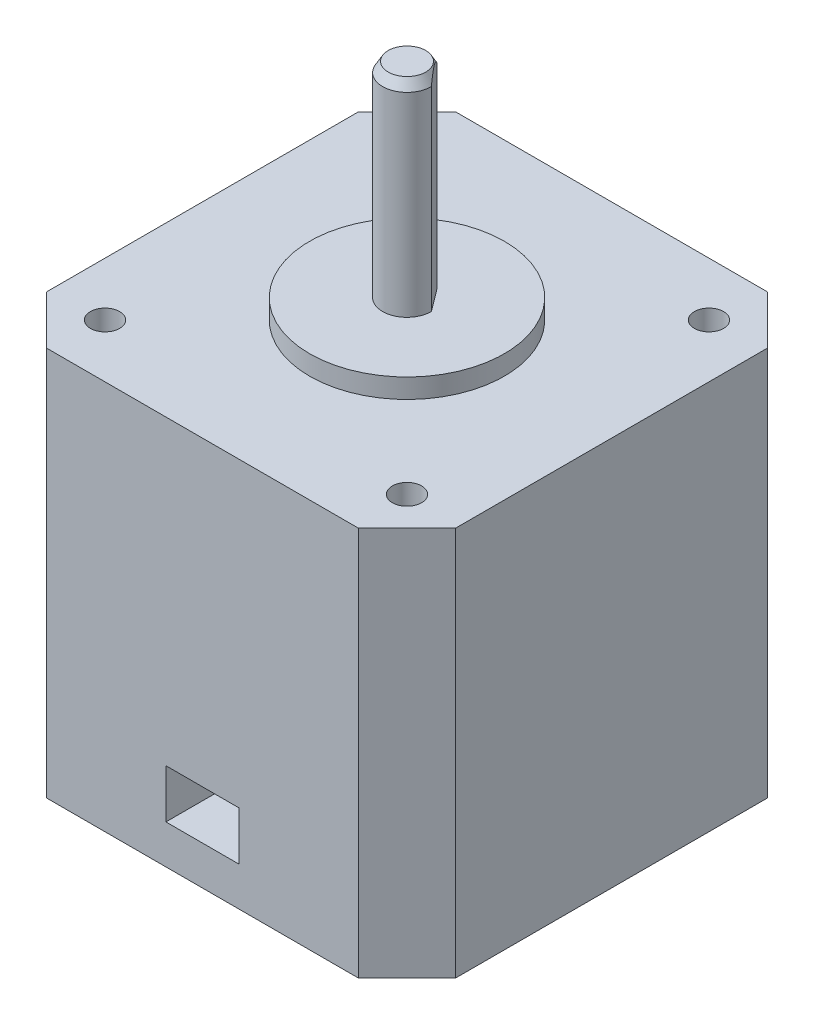
ISO-10303-21;
HEADER;
FILE_DESCRIPTION(('STEP AP214'),'2;1');
FILE_NAME('part.step','',(''),(''),'','','');
FILE_SCHEMA(('AUTOMOTIVE_DESIGN { 1 0 10303 214 1 1 1 1 }'));
ENDSEC;
DATA;
#1=APPLICATION_CONTEXT('core data for automotive mechanical design processes');
#2=APPLICATION_PROTOCOL_DEFINITION('international standard','automotive_design',2000,#1);
#3=PRODUCT_CONTEXT('',#1,'mechanical');
#4=PRODUCT('Part','Part','',(#3));
#5=PRODUCT_RELATED_PRODUCT_CATEGORY('part','',(#4));
#6=PRODUCT_DEFINITION_FORMATION('','',#4);
#7=PRODUCT_DEFINITION_CONTEXT('part definition',#1,'design');
#8=PRODUCT_DEFINITION('design','',#6,#7);
#9=PRODUCT_DEFINITION_SHAPE('','',#8);
#10=(LENGTH_UNIT() NAMED_UNIT(*) SI_UNIT(.MILLI.,.METRE.));
#11=(NAMED_UNIT(*) PLANE_ANGLE_UNIT() SI_UNIT($,.RADIAN.));
#12=(NAMED_UNIT(*) SI_UNIT($,.STERADIAN.) SOLID_ANGLE_UNIT());
#13=UNCERTAINTY_MEASURE_WITH_UNIT(LENGTH_MEASURE(1.E-05),#10,'distance_accuracy_value','');
#14=(GEOMETRIC_REPRESENTATION_CONTEXT(3) GLOBAL_UNCERTAINTY_ASSIGNED_CONTEXT((#13)) GLOBAL_UNIT_ASSIGNED_CONTEXT((#10,
#11,#12)) REPRESENTATION_CONTEXT('',''));
#15=CARTESIAN_POINT('',(0.,0.,0.));
#16=DIRECTION('',(0.,0.,1.));
#17=DIRECTION('',(1.,0.,0.));
#18=AXIS2_PLACEMENT_3D('',#15,#16,#17);
#19=CARTESIAN_POINT('',(0.,42.,0.));
#20=DIRECTION('',(0.,1.,0.));
#21=DIRECTION('',(0.,0.,1.));
#22=AXIS2_PLACEMENT_3D('',#19,#20,#21);
#23=PLANE('',#22);
#24=CARTESIAN_POINT('',(0.,42.,0.));
#25=DIRECTION('',(0.,1.,0.));
#26=DIRECTION('',(0.,0.,1.));
#27=AXIS2_PLACEMENT_3D('',#24,#25,#26);
#28=CIRCLE('',#27,10.);
#29=CARTESIAN_POINT('',(0.,42.,10.));
#30=VERTEX_POINT('',#29);
#31=EDGE_CURVE('E198',#30,#30,#28,.T.);
#32=ORIENTED_EDGE('',*,*,#31,.T.);
#33=EDGE_LOOP('',(#32));
#34=FACE_BOUND('',#33,.T.);
#35=DIRECTION('',(0.6,0.,0.8));
#36=VECTOR('',#35,1.);
#37=CARTESIAN_POINT('',(1.6,42.,-1.2));
#38=LINE('',#37,#36);
#39=CARTESIAN_POINT('',(0.7,42.,-2.4));
#40=VERTEX_POINT('',#39);
#41=CARTESIAN_POINT('',(2.5,42.,0.));
#42=VERTEX_POINT('',#41);
#43=EDGE_CURVE('E249',#40,#42,#38,.T.);
#44=ORIENTED_EDGE('',*,*,#43,.T.);
#45=CARTESIAN_POINT('',(0.,42.,0.));
#46=DIRECTION('',(0.,1.,0.));
#47=DIRECTION('',(0.,0.,1.));
#48=AXIS2_PLACEMENT_3D('',#45,#46,#47);
#49=CIRCLE('',#48,2.5);
#50=EDGE_CURVE('E252',#42,#40,#49,.F.);
#51=ORIENTED_EDGE('',*,*,#50,.T.);
#52=EDGE_LOOP('',(#44,#51));
#53=FACE_BOUND('',#52,.T.);
#54=ADVANCED_FACE('F35',(#34,#53),#23,.T.);
#55=CARTESIAN_POINT('',(21.,40.,21.));
#56=DIRECTION('',(-1.,0.,0.));
#57=DIRECTION('',(0.,0.,1.));
#58=AXIS2_PLACEMENT_3D('',#55,#56,#57);
#59=PLANE('',#58);
#60=DIRECTION('',(0.,0.,-1.));
#61=VECTOR('',#60,1.);
#62=CARTESIAN_POINT('',(21.,40.,21.));
#63=LINE('',#62,#61);
#64=CARTESIAN_POINT('',(21.,40.,16.));
#65=VERTEX_POINT('',#64);
#66=CARTESIAN_POINT('',(21.,40.,-16.));
#67=VERTEX_POINT('',#66);
#68=EDGE_CURVE('E226',#65,#67,#63,.T.);
#69=ORIENTED_EDGE('',*,*,#68,.F.);
#70=DIRECTION('',(0.,-1.,0.));
#71=VECTOR('',#70,1.);
#72=CARTESIAN_POINT('',(21.,40.,16.));
#73=LINE('',#72,#71);
#74=CARTESIAN_POINT('',(21.,0.,16.));
#75=VERTEX_POINT('',#74);
#76=EDGE_CURVE('E353',#65,#75,#73,.T.);
#77=ORIENTED_EDGE('',*,*,#76,.T.);
#78=DIRECTION('',(0.,0.,-1.));
#79=VECTOR('',#78,1.);
#80=CARTESIAN_POINT('',(21.,0.,21.));
#81=LINE('',#80,#79);
#82=CARTESIAN_POINT('',(21.,0.,-16.));
#83=VERTEX_POINT('',#82);
#84=EDGE_CURVE('E225',#75,#83,#81,.T.);
#85=ORIENTED_EDGE('',*,*,#84,.T.);
#86=DIRECTION('',(0.,1.,0.));
#87=VECTOR('',#86,1.);
#88=CARTESIAN_POINT('',(21.,40.,-16.));
#89=LINE('',#88,#87);
#90=EDGE_CURVE('E356',#83,#67,#89,.T.);
#91=ORIENTED_EDGE('',*,*,#90,.T.);
#92=EDGE_LOOP('',(#69,#77,#85,#91));
#93=FACE_BOUND('',#92,.T.);
#94=ADVANCED_FACE('F291',(#93),#59,.F.);
#95=CARTESIAN_POINT('',(-21.,40.,-21.));
#96=DIRECTION('',(0.,0.,1.));
#97=DIRECTION('',(1.,0.,0.));
#98=AXIS2_PLACEMENT_3D('',#95,#96,#97);
#99=PLANE('',#98);
#100=DIRECTION('',(-1.,0.,0.));
#101=VECTOR('',#100,1.);
#102=CARTESIAN_POINT('',(-21.,0.,-21.));
#103=LINE('',#102,#101);
#104=CARTESIAN_POINT('',(16.,0.,-21.));
#105=VERTEX_POINT('',#104);
#106=CARTESIAN_POINT('',(-16.,0.,-21.));
#107=VERTEX_POINT('',#106);
#108=EDGE_CURVE('E240',#105,#107,#103,.T.);
#109=ORIENTED_EDGE('',*,*,#108,.T.);
#110=DIRECTION('',(0.,1.,0.));
#111=VECTOR('',#110,1.);
#112=CARTESIAN_POINT('',(-16.,40.,-21.));
#113=LINE('',#112,#111);
#114=CARTESIAN_POINT('',(-16.,40.,-21.));
#115=VERTEX_POINT('',#114);
#116=EDGE_CURVE('E11',#107,#115,#113,.T.);
#117=ORIENTED_EDGE('',*,*,#116,.T.);
#118=DIRECTION('',(-1.,0.,0.));
#119=VECTOR('',#118,1.);
#120=CARTESIAN_POINT('',(-21.,40.,-21.));
#121=LINE('',#120,#119);
#122=CARTESIAN_POINT('',(16.,40.,-21.));
#123=VERTEX_POINT('',#122);
#124=EDGE_CURVE('E228',#123,#115,#121,.T.);
#125=ORIENTED_EDGE('',*,*,#124,.F.);
#126=DIRECTION('',(0.,-1.,0.));
#127=VECTOR('',#126,1.);
#128=CARTESIAN_POINT('',(16.,40.,-21.));
#129=LINE('',#128,#127);
#130=EDGE_CURVE('E44',#123,#105,#129,.T.);
#131=ORIENTED_EDGE('',*,*,#130,.T.);
#132=EDGE_LOOP('',(#109,#117,#125,#131));
#133=FACE_BOUND('',#132,.T.);
#134=ADVANCED_FACE('F343',(#133),#99,.F.);
#135=CARTESIAN_POINT('',(-21.,40.,21.));
#136=DIRECTION('',(1.,0.,0.));
#137=DIRECTION('',(0.,0.,-1.));
#138=AXIS2_PLACEMENT_3D('',#135,#136,#137);
#139=PLANE('',#138);
#140=DIRECTION('',(0.,0.,1.));
#141=VECTOR('',#140,1.);
#142=CARTESIAN_POINT('',(-21.,0.,21.));
#143=LINE('',#142,#141);
#144=CARTESIAN_POINT('',(-21.,0.,-16.));
#145=VERTEX_POINT('',#144);
#146=CARTESIAN_POINT('',(-21.,0.,16.));
#147=VERTEX_POINT('',#146);
#148=EDGE_CURVE('E242',#145,#147,#143,.T.);
#149=ORIENTED_EDGE('',*,*,#148,.T.);
#150=DIRECTION('',(0.,1.,0.));
#151=VECTOR('',#150,1.);
#152=CARTESIAN_POINT('',(-21.,40.,16.));
#153=LINE('',#152,#151);
#154=CARTESIAN_POINT('',(-21.,40.,16.));
#155=VERTEX_POINT('',#154);
#156=EDGE_CURVE('E373',#147,#155,#153,.T.);
#157=ORIENTED_EDGE('',*,*,#156,.T.);
#158=DIRECTION('',(0.,0.,1.));
#159=VECTOR('',#158,1.);
#160=CARTESIAN_POINT('',(-21.,40.,21.));
#161=LINE('',#160,#159);
#162=CARTESIAN_POINT('',(-21.,40.,-16.));
#163=VERTEX_POINT('',#162);
#164=EDGE_CURVE('E231',#163,#155,#161,.T.);
#165=ORIENTED_EDGE('',*,*,#164,.F.);
#166=DIRECTION('',(0.,-1.,0.));
#167=VECTOR('',#166,1.);
#168=CARTESIAN_POINT('',(-21.,40.,-16.));
#169=LINE('',#168,#167);
#170=EDGE_CURVE('E375',#163,#145,#169,.T.);
#171=ORIENTED_EDGE('',*,*,#170,.T.);
#172=EDGE_LOOP('',(#149,#157,#165,#171));
#173=FACE_BOUND('',#172,.T.);
#174=ADVANCED_FACE('F339',(#173),#139,.F.);
#175=CARTESIAN_POINT('',(-21.,40.,21.));
#176=DIRECTION('',(0.,0.,-1.));
#177=DIRECTION('',(-1.,0.,0.));
#178=AXIS2_PLACEMENT_3D('',#175,#176,#177);
#179=PLANE('',#178);
#180=DIRECTION('',(1.,0.,0.));
#181=VECTOR('',#180,1.);
#182=CARTESIAN_POINT('',(-3.75,4.,21.));
#183=LINE('',#182,#181);
#184=CARTESIAN_POINT('',(-3.75,4.,21.));
#185=VERTEX_POINT('',#184);
#186=CARTESIAN_POINT('',(3.75,4.,21.));
#187=VERTEX_POINT('',#186);
#188=EDGE_CURVE('E185',#185,#187,#183,.T.);
#189=ORIENTED_EDGE('',*,*,#188,.F.);
#190=DIRECTION('',(0.,-1.,0.));
#191=VECTOR('',#190,1.);
#192=CARTESIAN_POINT('',(-3.75,4.,21.));
#193=LINE('',#192,#191);
#194=CARTESIAN_POINT('',(-3.75,9.,21.));
#195=VERTEX_POINT('',#194);
#196=EDGE_CURVE('E159',#195,#185,#193,.T.);
#197=ORIENTED_EDGE('',*,*,#196,.F.);
#198=DIRECTION('',(-1.,0.,0.));
#199=VECTOR('',#198,1.);
#200=CARTESIAN_POINT('',(-3.75,9.,21.));
#201=LINE('',#200,#199);
#202=CARTESIAN_POINT('',(3.75,9.,21.));
#203=VERTEX_POINT('',#202);
#204=EDGE_CURVE('E176',#203,#195,#201,.T.);
#205=ORIENTED_EDGE('',*,*,#204,.F.);
#206=DIRECTION('',(0.,1.,0.));
#207=VECTOR('',#206,1.);
#208=CARTESIAN_POINT('',(3.75,4.,21.));
#209=LINE('',#208,#207);
#210=EDGE_CURVE('E179',#187,#203,#209,.T.);
#211=ORIENTED_EDGE('',*,*,#210,.F.);
#212=EDGE_LOOP('',(#189,#197,#205,#211));
#213=FACE_BOUND('',#212,.T.);
#214=DIRECTION('',(1.,0.,0.));
#215=VECTOR('',#214,1.);
#216=CARTESIAN_POINT('',(-21.,40.,21.));
#217=LINE('',#216,#215);
#218=CARTESIAN_POINT('',(-16.,40.,21.));
#219=VERTEX_POINT('',#218);
#220=CARTESIAN_POINT('',(16.,40.,21.));
#221=VERTEX_POINT('',#220);
#222=EDGE_CURVE('E234',#219,#221,#217,.T.);
#223=ORIENTED_EDGE('',*,*,#222,.F.);
#224=DIRECTION('',(0.,-1.,0.));
#225=VECTOR('',#224,1.);
#226=CARTESIAN_POINT('',(-16.,40.,21.));
#227=LINE('',#226,#225);
#228=CARTESIAN_POINT('',(-16.,0.,21.));
#229=VERTEX_POINT('',#228);
#230=EDGE_CURVE('E384',#219,#229,#227,.T.);
#231=ORIENTED_EDGE('',*,*,#230,.T.);
#232=DIRECTION('',(1.,0.,0.));
#233=VECTOR('',#232,1.);
#234=CARTESIAN_POINT('',(-21.,0.,21.));
#235=LINE('',#234,#233);
#236=CARTESIAN_POINT('',(16.,0.,21.));
#237=VERTEX_POINT('',#236);
#238=EDGE_CURVE('E229',#229,#237,#235,.T.);
#239=ORIENTED_EDGE('',*,*,#238,.T.);
#240=DIRECTION('',(0.,1.,0.));
#241=VECTOR('',#240,1.);
#242=CARTESIAN_POINT('',(16.,40.,21.));
#243=LINE('',#242,#241);
#244=EDGE_CURVE('E269',#237,#221,#243,.T.);
#245=ORIENTED_EDGE('',*,*,#244,.T.);
#246=EDGE_LOOP('',(#223,#231,#239,#245));
#247=FACE_BOUND('',#246,.T.);
#248=ADVANCED_FACE('F332',(#213,#247),#179,.F.);
#249=CARTESIAN_POINT('',(0.,40.,0.));
#250=DIRECTION('',(0.,-1.,0.));
#251=DIRECTION('',(0.,0.,-1.));
#252=AXIS2_PLACEMENT_3D('',#249,#250,#251);
#253=PLANE('',#252);
#254=CARTESIAN_POINT('',(0.,40.,0.));
#255=DIRECTION('',(0.,-1.,0.));
#256=DIRECTION('',(0.,0.,-1.));
#257=AXIS2_PLACEMENT_3D('',#254,#255,#256);
#258=CIRCLE('',#257,10.);
#259=CARTESIAN_POINT('',(0.,40.,-10.));
#260=VERTEX_POINT('',#259);
#261=EDGE_CURVE('E237',#260,#260,#258,.F.);
#262=ORIENTED_EDGE('',*,*,#261,.F.);
#263=EDGE_LOOP('',(#262));
#264=FACE_BOUND('',#263,.T.);
#265=CARTESIAN_POINT('',(-15.5,40.,-15.5));
#266=DIRECTION('',(0.,1.,0.));
#267=DIRECTION('',(0.,0.,1.));
#268=AXIS2_PLACEMENT_3D('',#265,#266,#267);
#269=CIRCLE('',#268,1.5);
#270=CARTESIAN_POINT('',(-15.5,40.,-14.));
#271=VERTEX_POINT('',#270);
#272=EDGE_CURVE('E201',#271,#271,#269,.T.);
#273=ORIENTED_EDGE('',*,*,#272,.F.);
#274=EDGE_LOOP('',(#273));
#275=FACE_BOUND('',#274,.T.);
#276=CARTESIAN_POINT('',(15.5,40.,-15.5));
#277=DIRECTION('',(0.,1.,0.));
#278=DIRECTION('',(0.,0.,1.));
#279=AXIS2_PLACEMENT_3D('',#276,#277,#278);
#280=CIRCLE('',#279,1.5);
#281=CARTESIAN_POINT('',(15.5,40.,-14.));
#282=VERTEX_POINT('',#281);
#283=EDGE_CURVE('E207',#282,#282,#280,.T.);
#284=ORIENTED_EDGE('',*,*,#283,.F.);
#285=EDGE_LOOP('',(#284));
#286=FACE_BOUND('',#285,.T.);
#287=CARTESIAN_POINT('',(15.5,40.,15.5));
#288=DIRECTION('',(0.,1.,0.));
#289=DIRECTION('',(0.,0.,1.));
#290=AXIS2_PLACEMENT_3D('',#287,#288,#289);
#291=CIRCLE('',#290,1.5);
#292=CARTESIAN_POINT('',(15.5,40.,17.));
#293=VERTEX_POINT('',#292);
#294=EDGE_CURVE('E213',#293,#293,#291,.T.);
#295=ORIENTED_EDGE('',*,*,#294,.F.);
#296=EDGE_LOOP('',(#295));
#297=FACE_BOUND('',#296,.T.);
#298=CARTESIAN_POINT('',(-15.5,40.,15.5));
#299=DIRECTION('',(0.,1.,0.));
#300=DIRECTION('',(0.,0.,1.));
#301=AXIS2_PLACEMENT_3D('',#298,#299,#300);
#302=CIRCLE('',#301,1.5);
#303=CARTESIAN_POINT('',(-15.5,40.,17.));
#304=VERTEX_POINT('',#303);
#305=EDGE_CURVE('E219',#304,#304,#302,.T.);
#306=ORIENTED_EDGE('',*,*,#305,.F.);
#307=EDGE_LOOP('',(#306));
#308=FACE_BOUND('',#307,.T.);
#309=ORIENTED_EDGE('',*,*,#164,.T.);
#310=DIRECTION('',(-0.707106781186546,0.,-0.707106781186549));
#311=VECTOR('',#310,1.);
#312=CARTESIAN_POINT('',(-16.,40.,21.));
#313=LINE('',#312,#311);
#314=EDGE_CURVE('E365',#155,#219,#313,.F.);
#315=ORIENTED_EDGE('',*,*,#314,.T.);
#316=ORIENTED_EDGE('',*,*,#222,.T.);
#317=DIRECTION('',(-0.707106781186549,0.,0.707106781186546));
#318=VECTOR('',#317,1.);
#319=CARTESIAN_POINT('',(21.,40.,16.));
#320=LINE('',#319,#318);
#321=EDGE_CURVE('E361',#221,#65,#320,.F.);
#322=ORIENTED_EDGE('',*,*,#321,.T.);
#323=ORIENTED_EDGE('',*,*,#68,.T.);
#324=DIRECTION('',(0.707106781186546,0.,0.70710678118655));
#325=VECTOR('',#324,1.);
#326=CARTESIAN_POINT('',(16.,40.,-21.));
#327=LINE('',#326,#325);
#328=EDGE_CURVE('E56',#67,#123,#327,.F.);
#329=ORIENTED_EDGE('',*,*,#328,.T.);
#330=ORIENTED_EDGE('',*,*,#124,.T.);
#331=DIRECTION('',(0.707106781186549,0.,-0.707106781186546));
#332=VECTOR('',#331,1.);
#333=CARTESIAN_POINT('',(-21.,40.,-16.));
#334=LINE('',#333,#332);
#335=EDGE_CURVE('E370',#115,#163,#334,.F.);
#336=ORIENTED_EDGE('',*,*,#335,.T.);
#337=EDGE_LOOP('',(#309,#315,#316,#322,#323,#329,#330,#336));
#338=FACE_BOUND('',#337,.T.);
#339=ADVANCED_FACE('F329',(#264,#275,#286,#297,#308,#338),#253,.F.);
#340=CARTESIAN_POINT('',(0.,0.,0.));
#341=DIRECTION('',(0.,-1.,0.));
#342=DIRECTION('',(0.,0.,-1.));
#343=AXIS2_PLACEMENT_3D('',#340,#341,#342);
#344=PLANE('',#343);
#345=ORIENTED_EDGE('',*,*,#238,.F.);
#346=DIRECTION('',(0.707106781186546,0.,0.707106781186549));
#347=VECTOR('',#346,1.);
#348=CARTESIAN_POINT('',(-18.5,0.,18.5));
#349=LINE('',#348,#347);
#350=EDGE_CURVE('E378',#229,#147,#349,.F.);
#351=ORIENTED_EDGE('',*,*,#350,.T.);
#352=ORIENTED_EDGE('',*,*,#148,.F.);
#353=DIRECTION('',(-0.707106781186549,0.,0.707106781186546));
#354=VECTOR('',#353,1.);
#355=CARTESIAN_POINT('',(-18.5,0.,-18.5));
#356=LINE('',#355,#354);
#357=EDGE_CURVE('E381',#145,#107,#356,.F.);
#358=ORIENTED_EDGE('',*,*,#357,.T.);
#359=ORIENTED_EDGE('',*,*,#108,.F.);
#360=DIRECTION('',(-0.707106781186546,0.,-0.70710678118655));
#361=VECTOR('',#360,1.);
#362=CARTESIAN_POINT('',(18.5,0.,-18.4999999999999));
#363=LINE('',#362,#361);
#364=EDGE_CURVE('E383',#105,#83,#363,.F.);
#365=ORIENTED_EDGE('',*,*,#364,.T.);
#366=ORIENTED_EDGE('',*,*,#84,.F.);
#367=DIRECTION('',(0.707106781186549,0.,-0.707106781186546));
#368=VECTOR('',#367,1.);
#369=CARTESIAN_POINT('',(18.5,0.,18.5));
#370=LINE('',#369,#368);
#371=EDGE_CURVE('E362',#75,#237,#370,.F.);
#372=ORIENTED_EDGE('',*,*,#371,.T.);
#373=EDGE_LOOP('',(#345,#351,#352,#358,#359,#365,#366,#372));
#374=FACE_BOUND('',#373,.T.);
#375=ADVANCED_FACE('F327',(#374),#344,.T.);
#376=CARTESIAN_POINT('',(-15.5,35.5,15.5));
#377=DIRECTION('',(0.,1.,0.));
#378=DIRECTION('',(0.,0.,1.));
#379=AXIS2_PLACEMENT_3D('',#376,#377,#378);
#380=CONICAL_SURFACE('',#379,1.5,1.02974425867665);
#381=CARTESIAN_POINT('',(-15.5,34.5987090714587,15.5));
#382=VERTEX_POINT('',#381);
#383=VERTEX_LOOP('',#382);
#384=FACE_BOUND('',#383,.T.);
#385=CARTESIAN_POINT('',(-15.5,35.5,15.5));
#386=DIRECTION('',(0.,1.,0.));
#387=DIRECTION('',(0.,0.,1.));
#388=AXIS2_PLACEMENT_3D('',#385,#386,#387);
#389=CIRCLE('',#388,1.5);
#390=CARTESIAN_POINT('',(-15.5,35.5,17.));
#391=VERTEX_POINT('',#390);
#392=EDGE_CURVE('E222',#391,#391,#389,.T.);
#393=ORIENTED_EDGE('',*,*,#392,.T.);
#394=EDGE_LOOP('',(#393));
#395=FACE_BOUND('',#394,.T.);
#396=ADVANCED_FACE('F323',(#384,#395),#380,.F.);
#397=CARTESIAN_POINT('',(-15.5,40.,15.5));
#398=DIRECTION('',(0.,1.,0.));
#399=DIRECTION('',(0.,0.,1.));
#400=AXIS2_PLACEMENT_3D('',#397,#398,#399);
#401=CYLINDRICAL_SURFACE('',#400,1.5);
#402=ORIENTED_EDGE('',*,*,#392,.F.);
#403=EDGE_LOOP('',(#402));
#404=FACE_BOUND('',#403,.T.);
#405=ORIENTED_EDGE('',*,*,#305,.T.);
#406=EDGE_LOOP('',(#405));
#407=FACE_BOUND('',#406,.T.);
#408=ADVANCED_FACE('F319',(#404,#407),#401,.F.);
#409=CARTESIAN_POINT('',(15.5,35.5,15.5));
#410=DIRECTION('',(0.,1.,0.));
#411=DIRECTION('',(0.,0.,1.));
#412=AXIS2_PLACEMENT_3D('',#409,#410,#411);
#413=CONICAL_SURFACE('',#412,1.5,1.02974425867665);
#414=CARTESIAN_POINT('',(15.5,34.5987090714587,15.5));
#415=VERTEX_POINT('',#414);
#416=VERTEX_LOOP('',#415);
#417=FACE_BOUND('',#416,.T.);
#418=CARTESIAN_POINT('',(15.5,35.5,15.5));
#419=DIRECTION('',(0.,1.,0.));
#420=DIRECTION('',(0.,0.,1.));
#421=AXIS2_PLACEMENT_3D('',#418,#419,#420);
#422=CIRCLE('',#421,1.5);
#423=CARTESIAN_POINT('',(15.5,35.5,17.));
#424=VERTEX_POINT('',#423);
#425=EDGE_CURVE('E216',#424,#424,#422,.T.);
#426=ORIENTED_EDGE('',*,*,#425,.T.);
#427=EDGE_LOOP('',(#426));
#428=FACE_BOUND('',#427,.T.);
#429=ADVANCED_FACE('F315',(#417,#428),#413,.F.);
#430=CARTESIAN_POINT('',(15.5,40.,15.5));
#431=DIRECTION('',(0.,1.,0.));
#432=DIRECTION('',(0.,0.,1.));
#433=AXIS2_PLACEMENT_3D('',#430,#431,#432);
#434=CYLINDRICAL_SURFACE('',#433,1.5);
#435=ORIENTED_EDGE('',*,*,#425,.F.);
#436=EDGE_LOOP('',(#435));
#437=FACE_BOUND('',#436,.T.);
#438=ORIENTED_EDGE('',*,*,#294,.T.);
#439=EDGE_LOOP('',(#438));
#440=FACE_BOUND('',#439,.T.);
#441=ADVANCED_FACE('F311',(#437,#440),#434,.F.);
#442=CARTESIAN_POINT('',(15.5,35.5,-15.5));
#443=DIRECTION('',(0.,1.,0.));
#444=DIRECTION('',(0.,0.,1.));
#445=AXIS2_PLACEMENT_3D('',#442,#443,#444);
#446=CONICAL_SURFACE('',#445,1.5,1.02974425867665);
#447=CARTESIAN_POINT('',(15.5,34.5987090714587,-15.5));
#448=VERTEX_POINT('',#447);
#449=VERTEX_LOOP('',#448);
#450=FACE_BOUND('',#449,.T.);
#451=CARTESIAN_POINT('',(15.5,35.5,-15.5));
#452=DIRECTION('',(0.,1.,0.));
#453=DIRECTION('',(0.,0.,1.));
#454=AXIS2_PLACEMENT_3D('',#451,#452,#453);
#455=CIRCLE('',#454,1.5);
#456=CARTESIAN_POINT('',(15.5,35.5,-14.));
#457=VERTEX_POINT('',#456);
#458=EDGE_CURVE('E210',#457,#457,#455,.T.);
#459=ORIENTED_EDGE('',*,*,#458,.T.);
#460=EDGE_LOOP('',(#459));
#461=FACE_BOUND('',#460,.T.);
#462=ADVANCED_FACE('F307',(#450,#461),#446,.F.);
#463=CARTESIAN_POINT('',(15.5,40.,-15.5));
#464=DIRECTION('',(0.,1.,0.));
#465=DIRECTION('',(0.,0.,1.));
#466=AXIS2_PLACEMENT_3D('',#463,#464,#465);
#467=CYLINDRICAL_SURFACE('',#466,1.5);
#468=ORIENTED_EDGE('',*,*,#458,.F.);
#469=EDGE_LOOP('',(#468));
#470=FACE_BOUND('',#469,.T.);
#471=ORIENTED_EDGE('',*,*,#283,.T.);
#472=EDGE_LOOP('',(#471));
#473=FACE_BOUND('',#472,.T.);
#474=ADVANCED_FACE('F303',(#470,#473),#467,.F.);
#475=CARTESIAN_POINT('',(-15.5,35.5,-15.5));
#476=DIRECTION('',(0.,1.,0.));
#477=DIRECTION('',(0.,0.,1.));
#478=AXIS2_PLACEMENT_3D('',#475,#476,#477);
#479=CONICAL_SURFACE('',#478,1.5,1.02974425867665);
#480=CARTESIAN_POINT('',(-15.5,34.5987090714587,-15.5));
#481=VERTEX_POINT('',#480);
#482=VERTEX_LOOP('',#481);
#483=FACE_BOUND('',#482,.T.);
#484=CARTESIAN_POINT('',(-15.5,35.5,-15.5));
#485=DIRECTION('',(0.,1.,0.));
#486=DIRECTION('',(0.,0.,1.));
#487=AXIS2_PLACEMENT_3D('',#484,#485,#486);
#488=CIRCLE('',#487,1.5);
#489=CARTESIAN_POINT('',(-15.5,35.5,-14.));
#490=VERTEX_POINT('',#489);
#491=EDGE_CURVE('E204',#490,#490,#488,.T.);
#492=ORIENTED_EDGE('',*,*,#491,.T.);
#493=EDGE_LOOP('',(#492));
#494=FACE_BOUND('',#493,.T.);
#495=ADVANCED_FACE('F299',(#483,#494),#479,.F.);
#496=CARTESIAN_POINT('',(-15.5,40.,-15.5));
#497=DIRECTION('',(0.,1.,0.));
#498=DIRECTION('',(0.,0.,1.));
#499=AXIS2_PLACEMENT_3D('',#496,#497,#498);
#500=CYLINDRICAL_SURFACE('',#499,1.5);
#501=ORIENTED_EDGE('',*,*,#491,.F.);
#502=EDGE_LOOP('',(#501));
#503=FACE_BOUND('',#502,.T.);
#504=ORIENTED_EDGE('',*,*,#272,.T.);
#505=EDGE_LOOP('',(#504));
#506=FACE_BOUND('',#505,.T.);
#507=ADVANCED_FACE('F295',(#503,#506),#500,.F.);
#508=CARTESIAN_POINT('',(0.,42.,0.));
#509=DIRECTION('',(0.,-1.,0.));
#510=DIRECTION('',(0.,0.,-1.));
#511=AXIS2_PLACEMENT_3D('',#508,#509,#510);
#512=CYLINDRICAL_SURFACE('',#511,10.);
#513=ORIENTED_EDGE('',*,*,#31,.F.);
#514=EDGE_LOOP('',(#513));
#515=FACE_BOUND('',#514,.T.);
#516=ORIENTED_EDGE('',*,*,#261,.T.);
#517=EDGE_LOOP('',(#516));
#518=FACE_BOUND('',#517,.T.);
#519=ADVANCED_FACE('F287',(#515,#518),#512,.T.);
#520=CARTESIAN_POINT('',(0.,63.,0.));
#521=DIRECTION('',(0.,-1.,0.));
#522=DIRECTION('',(0.,0.,-1.));
#523=AXIS2_PLACEMENT_3D('',#520,#521,#522);
#524=CYLINDRICAL_SURFACE('',#523,2.5);
#525=DIRECTION('',(0.,-1.,0.));
#526=VECTOR('',#525,1.);
#527=CARTESIAN_POINT('',(2.5,63.,0.));
#528=LINE('',#527,#526);
#529=CARTESIAN_POINT('',(2.5,62.,0.));
#530=VERTEX_POINT('',#529);
#531=EDGE_CURVE('E196',#530,#42,#528,.T.);
#532=ORIENTED_EDGE('',*,*,#531,.F.);
#533=CARTESIAN_POINT('',(0.,62.,0.));
#534=DIRECTION('',(0.,1.,0.));
#535=DIRECTION('',(0.,0.,1.));
#536=AXIS2_PLACEMENT_3D('',#533,#534,#535);
#537=CIRCLE('',#536,2.5);
#538=CARTESIAN_POINT('',(0.7,62.,-2.4));
#539=VERTEX_POINT('',#538);
#540=EDGE_CURVE('E258',#530,#539,#537,.F.);
#541=ORIENTED_EDGE('',*,*,#540,.T.);
#542=DIRECTION('',(0.,-1.,0.));
#543=VECTOR('',#542,1.);
#544=CARTESIAN_POINT('',(0.7,63.,-2.4));
#545=LINE('',#544,#543);
#546=EDGE_CURVE('E191',#539,#40,#545,.T.);
#547=ORIENTED_EDGE('',*,*,#546,.T.);
#548=ORIENTED_EDGE('',*,*,#50,.F.);
#549=EDGE_LOOP('',(#532,#541,#547,#548));
#550=FACE_BOUND('',#549,.T.);
#551=ADVANCED_FACE('F282',(#550),#524,.T.);
#552=CARTESIAN_POINT('',(0.7,63.,-2.4));
#553=DIRECTION('',(-0.8,0.,0.6));
#554=DIRECTION('',(0.6,0.,0.8));
#555=AXIS2_PLACEMENT_3D('',#552,#553,#554);
#556=PLANE('',#555);
#557=ORIENTED_EDGE('',*,*,#546,.F.);
#558=CARTESIAN_POINT('',(0.7,62.,-2.4));
#559=CARTESIAN_POINT('',(0.73181244051654,62.0550409365669,-2.35758341264461));
#560=CARTESIAN_POINT('',(0.764165642503277,62.1092643330759,-2.31444580999563));
#561=CARTESIAN_POINT('',(0.830349987484121,62.2155333396937,-2.22620001668784));
#562=CARTESIAN_POINT('',(0.864185930330915,62.2675706154829,-2.18108542622545));
#563=CARTESIAN_POINT('',(0.934376115493969,62.3697849829891,-2.08749851267471));
#564=CARTESIAN_POINT('',(0.970772102456951,62.4198833982926,-2.0389705300574));
#565=CARTESIAN_POINT('',(1.04562787467161,62.5154601677717,-1.93916283377118));
#566=CARTESIAN_POINT('',(1.0840845261481,62.5609452491443,-1.8878872984692));
#567=CARTESIAN_POINT('',(1.16486545151919,62.6469632653169,-1.78017939797442));
#568=CARTESIAN_POINT('',(1.20727710276391,62.6872730794819,-1.72363052964811));
#569=CARTESIAN_POINT('',(1.29483063597038,62.7578039784106,-1.60689248537283));
#570=CARTESIAN_POINT('',(1.33995572270854,62.7880808243266,-1.54672570305528));
#571=CARTESIAN_POINT('',(1.42540194277302,62.8313044905595,-1.43279740963597));
#572=CARTESIAN_POINT('',(1.46535146448941,62.8462370043879,-1.37953138068079));
#573=CARTESIAN_POINT('',(1.54620016382858,62.8644890080976,-1.27173311489522));
#574=CARTESIAN_POINT('',(1.58709846287693,62.8678188414534,-1.21720204949743));
#575=CARTESIAN_POINT('',(1.66860198490926,62.8623663305026,-1.10853068678765));
#576=CARTESIAN_POINT('',(1.70920710980103,62.8535801054087,-1.0543905202653));
#577=CARTESIAN_POINT('',(1.78902078405367,62.8251865885972,-0.947972287928437));
#578=CARTESIAN_POINT('',(1.82822799344816,62.8055691966208,-0.895696008735781));
#579=CARTESIAN_POINT('',(1.89642445651622,62.7629069616425,-0.8047673913117));
#580=CARTESIAN_POINT('',(1.92579811528835,62.7415060169708,-0.765602512948868));
#581=CARTESIAN_POINT('',(1.98330954967971,62.6944639272549,-0.688920600427054));
#582=CARTESIAN_POINT('',(2.01144647877292,62.668819933387,-0.651404694969445));
#583=CARTESIAN_POINT('',(2.06682385320476,62.6139013901694,-0.577568195726979));
#584=CARTESIAN_POINT('',(2.09405088143292,62.5845897024783,-0.541265491422772));
#585=CARTESIAN_POINT('',(2.14737599691557,62.523308223364,-0.4701653374459));
#586=CARTESIAN_POINT('',(2.17347461933247,62.4913397134728,-0.435367174223379));
#587=CARTESIAN_POINT('',(2.25407648861619,62.3874321925921,-0.327898015178416));
#588=CARTESIAN_POINT('',(2.30681996362282,62.3117096290287,-0.25757338183624));
#589=CARTESIAN_POINT('',(2.40897781880273,62.154215607121,-0.121362908263023));
#590=CARTESIAN_POINT('',(2.45838782761223,62.0724364901926,-0.0554828965170224));
#591=CARTESIAN_POINT('',(2.55493920359036,61.9044258784634,0.0732522714538108));
#592=CARTESIAN_POINT('',(2.60206704577668,61.8181729380512,0.136089394368904));
#593=CARTESIAN_POINT('',(2.69439013252274,61.6428362503479,0.259186843363651));
#594=CARTESIAN_POINT('',(2.73958501587968,61.5537519793538,0.319446687839574));
#595=CARTESIAN_POINT('',(2.82407988938142,61.3824333031474,0.432106519175229));
#596=CARTESIAN_POINT('',(2.86352117960064,61.300391538564,0.484694906134189));
#597=CARTESIAN_POINT('',(2.94142115911405,61.1350052927962,0.588561545485394));
#598=CARTESIAN_POINT('',(2.97987969695521,61.0516606139702,0.639839595940277));
#599=CARTESIAN_POINT('',(3.05551756796358,60.8849911103412,0.740690090618104));
#600=CARTESIAN_POINT('',(3.09270683708628,60.8016787744223,0.790275782781711));
#601=CARTESIAN_POINT('',(3.16641264718145,60.6342668179327,0.888550196241937));
#602=CARTESIAN_POINT('',(3.20292937425093,60.5501674251635,0.937239165667902));
#603=CARTESIAN_POINT('',(3.23917833847006,60.4657532065777,0.985571117960082));
#604=B_SPLINE_CURVE_WITH_KNOTS('',3,(#558,#559,#560,#561,#562,#563,#564,#565,#566,#567,#568,
#569,#570,#571,#572,#573,#574,#575,#576,#577,#578,#579,#580,#581,#582,#583,#584,#585,#586,#587,
#588,#589,#590,#591,#592,#593,#594,#595,#596,#597,#598,#599,#600,#601,#602,#603),.UNSPECIFIED.,
.F.,.F.,(4,2,2,2,2,2,2,2,2,2,2,2,2,2,2,2,2,2,2,2,2,2,4),(0.,0.229318375835106,0.459443653273783,
0.695303918471045,0.930815150450388,1.17439710123989,1.41660163513165,1.62043219090024,
1.82408099071273,2.02779503461811,2.231699367186,2.39176113290585,2.55193080498214,
2.7138782961634,2.87574811953687,3.22330471537866,3.57130856199821,3.92117093332953,
4.27109839865358,4.58645899933651,4.90186791100103,5.213378098533,5.5248007531828),.UNSPECIFIED.);
#605=EDGE_CURVE('E261',#539,#530,#604,.T.);
#606=ORIENTED_EDGE('',*,*,#605,.T.);
#607=ORIENTED_EDGE('',*,*,#531,.T.);
#608=ORIENTED_EDGE('',*,*,#43,.F.);
#609=EDGE_LOOP('',(#557,#606,#607,#608));
#610=FACE_BOUND('',#609,.T.);
#611=ADVANCED_FACE('F276',(#610),#556,.F.);
#612=CARTESIAN_POINT('',(0.,63.,0.));
#613=DIRECTION('',(0.,1.,0.));
#614=DIRECTION('',(0.,0.,1.));
#615=AXIS2_PLACEMENT_3D('',#612,#613,#614);
#616=PLANE('',#615);
#617=CARTESIAN_POINT('',(0.,63.,0.));
#618=DIRECTION('',(0.,1.,0.));
#619=DIRECTION('',(0.,0.,1.));
#620=AXIS2_PLACEMENT_3D('',#617,#618,#619);
#621=CIRCLE('',#620,1.92264973081037);
#622=CARTESIAN_POINT('',(0.538341924626904,63.,-1.84574374157796));
#623=VERTEX_POINT('',#622);
#624=EDGE_CURVE('E255',#623,#623,#621,.T.);
#625=ORIENTED_EDGE('',*,*,#624,.T.);
#626=EDGE_LOOP('',(#625));
#627=FACE_BOUND('',#626,.T.);
#628=ADVANCED_FACE('F281',(#627),#616,.T.);
#629=CARTESIAN_POINT('',(-3.75,4.,16.));
#630=DIRECTION('',(-1.,0.,0.));
#631=DIRECTION('',(0.,0.,1.));
#632=AXIS2_PLACEMENT_3D('',#629,#630,#631);
#633=PLANE('',#632);
#634=ORIENTED_EDGE('',*,*,#196,.T.);
#635=DIRECTION('',(0.,0.,1.));
#636=VECTOR('',#635,1.);
#637=CARTESIAN_POINT('',(-3.75,4.,16.));
#638=LINE('',#637,#636);
#639=CARTESIAN_POINT('',(-3.75,4.,16.));
#640=VERTEX_POINT('',#639);
#641=EDGE_CURVE('E152',#640,#185,#638,.T.);
#642=ORIENTED_EDGE('',*,*,#641,.F.);
#643=DIRECTION('',(0.,-1.,0.));
#644=VECTOR('',#643,1.);
#645=CARTESIAN_POINT('',(-3.75,4.,16.));
#646=LINE('',#645,#644);
#647=CARTESIAN_POINT('',(-3.75,9.,16.));
#648=VERTEX_POINT('',#647);
#649=EDGE_CURVE('E156',#648,#640,#646,.T.);
#650=ORIENTED_EDGE('',*,*,#649,.F.);
#651=DIRECTION('',(0.,0.,1.));
#652=VECTOR('',#651,1.);
#653=CARTESIAN_POINT('',(-3.75,9.,16.));
#654=LINE('',#653,#652);
#655=EDGE_CURVE('E189',#648,#195,#654,.T.);
#656=ORIENTED_EDGE('',*,*,#655,.T.);
#657=EDGE_LOOP('',(#634,#642,#650,#656));
#658=FACE_BOUND('',#657,.T.);
#659=ADVANCED_FACE('F154',(#658),#633,.F.);
#660=CARTESIAN_POINT('',(-3.75,9.,16.));
#661=DIRECTION('',(0.,1.,0.));
#662=DIRECTION('',(0.,0.,1.));
#663=AXIS2_PLACEMENT_3D('',#660,#661,#662);
#664=PLANE('',#663);
#665=ORIENTED_EDGE('',*,*,#204,.T.);
#666=ORIENTED_EDGE('',*,*,#655,.F.);
#667=DIRECTION('',(-1.,0.,0.));
#668=VECTOR('',#667,1.);
#669=CARTESIAN_POINT('',(-3.75,9.,16.));
#670=LINE('',#669,#668);
#671=CARTESIAN_POINT('',(3.75,9.,16.));
#672=VERTEX_POINT('',#671);
#673=EDGE_CURVE('E164',#672,#648,#670,.T.);
#674=ORIENTED_EDGE('',*,*,#673,.F.);
#675=DIRECTION('',(0.,0.,1.));
#676=VECTOR('',#675,1.);
#677=CARTESIAN_POINT('',(3.75,9.,16.));
#678=LINE('',#677,#676);
#679=EDGE_CURVE('E192',#672,#203,#678,.T.);
#680=ORIENTED_EDGE('',*,*,#679,.T.);
#681=EDGE_LOOP('',(#665,#666,#674,#680));
#682=FACE_BOUND('',#681,.T.);
#683=ADVANCED_FACE('F436',(#682),#664,.F.);
#684=CARTESIAN_POINT('',(3.75,4.,16.));
#685=DIRECTION('',(1.,0.,0.));
#686=DIRECTION('',(0.,1.,0.));
#687=AXIS2_PLACEMENT_3D('',#684,#685,#686);
#688=PLANE('',#687);
#689=ORIENTED_EDGE('',*,*,#210,.T.);
#690=ORIENTED_EDGE('',*,*,#679,.F.);
#691=DIRECTION('',(0.,1.,0.));
#692=VECTOR('',#691,1.);
#693=CARTESIAN_POINT('',(3.75,4.,16.));
#694=LINE('',#693,#692);
#695=CARTESIAN_POINT('',(3.75,4.,16.));
#696=VERTEX_POINT('',#695);
#697=EDGE_CURVE('E172',#696,#672,#694,.T.);
#698=ORIENTED_EDGE('',*,*,#697,.F.);
#699=DIRECTION('',(0.,0.,1.));
#700=VECTOR('',#699,1.);
#701=CARTESIAN_POINT('',(3.75,4.,16.));
#702=LINE('',#701,#700);
#703=EDGE_CURVE('E163',#696,#187,#702,.T.);
#704=ORIENTED_EDGE('',*,*,#703,.T.);
#705=EDGE_LOOP('',(#689,#690,#698,#704));
#706=FACE_BOUND('',#705,.T.);
#707=ADVANCED_FACE('F440',(#706),#688,.F.);
#708=CARTESIAN_POINT('',(-3.75,4.,16.));
#709=DIRECTION('',(0.,-1.,0.));
#710=DIRECTION('',(0.,0.,-1.));
#711=AXIS2_PLACEMENT_3D('',#708,#709,#710);
#712=PLANE('',#711);
#713=ORIENTED_EDGE('',*,*,#188,.T.);
#714=ORIENTED_EDGE('',*,*,#703,.F.);
#715=DIRECTION('',(1.,0.,0.));
#716=VECTOR('',#715,1.);
#717=CARTESIAN_POINT('',(-3.75,4.,16.));
#718=LINE('',#717,#716);
#719=EDGE_CURVE('E167',#640,#696,#718,.T.);
#720=ORIENTED_EDGE('',*,*,#719,.F.);
#721=ORIENTED_EDGE('',*,*,#641,.T.);
#722=EDGE_LOOP('',(#713,#714,#720,#721));
#723=FACE_BOUND('',#722,.T.);
#724=ADVANCED_FACE('F168',(#723),#712,.F.);
#725=CARTESIAN_POINT('',(0.,0.,16.));
#726=DIRECTION('',(0.,0.,-1.));
#727=DIRECTION('',(-1.,0.,0.));
#728=AXIS2_PLACEMENT_3D('',#725,#726,#727);
#729=PLANE('',#728);
#730=ORIENTED_EDGE('',*,*,#649,.T.);
#731=ORIENTED_EDGE('',*,*,#719,.T.);
#732=ORIENTED_EDGE('',*,*,#697,.T.);
#733=ORIENTED_EDGE('',*,*,#673,.T.);
#734=EDGE_LOOP('',(#730,#731,#732,#733));
#735=FACE_BOUND('',#734,.T.);
#736=ADVANCED_FACE('F174',(#735),#729,.F.);
#737=CARTESIAN_POINT('',(0.,63.,0.));
#738=DIRECTION('',(0.,-1.,0.));
#739=DIRECTION('',(0.,0.,-1.));
#740=AXIS2_PLACEMENT_3D('',#737,#738,#739);
#741=CONICAL_SURFACE('',#740,1.92264973081037,0.523598775598301);
#742=ORIENTED_EDGE('',*,*,#605,.F.);
#743=ORIENTED_EDGE('',*,*,#540,.F.);
#744=EDGE_LOOP('',(#742,#743));
#745=FACE_BOUND('',#744,.T.);
#746=ORIENTED_EDGE('',*,*,#624,.F.);
#747=EDGE_LOOP('',(#746));
#748=FACE_BOUND('',#747,.T.);
#749=ADVANCED_FACE('F272',(#745,#748),#741,.T.);
#750=CARTESIAN_POINT('',(-16.,40.,21.));
#751=DIRECTION('',(0.707106781186549,0.,-0.707106781186546));
#752=DIRECTION('',(0.,-1.,0.));
#753=AXIS2_PLACEMENT_3D('',#750,#751,#752);
#754=PLANE('',#753);
#755=ORIENTED_EDGE('',*,*,#314,.F.);
#756=ORIENTED_EDGE('',*,*,#156,.F.);
#757=ORIENTED_EDGE('',*,*,#350,.F.);
#758=ORIENTED_EDGE('',*,*,#230,.F.);
#759=EDGE_LOOP('',(#755,#756,#757,#758));
#760=FACE_BOUND('',#759,.T.);
#761=ADVANCED_FACE('F394',(#760),#754,.F.);
#762=CARTESIAN_POINT('',(21.,40.,16.));
#763=DIRECTION('',(-0.707106781186546,0.,-0.707106781186549));
#764=DIRECTION('',(0.,-1.,0.));
#765=AXIS2_PLACEMENT_3D('',#762,#763,#764);
#766=PLANE('',#765);
#767=ORIENTED_EDGE('',*,*,#321,.F.);
#768=ORIENTED_EDGE('',*,*,#244,.F.);
#769=ORIENTED_EDGE('',*,*,#371,.F.);
#770=ORIENTED_EDGE('',*,*,#76,.F.);
#771=EDGE_LOOP('',(#767,#768,#769,#770));
#772=FACE_BOUND('',#771,.T.);
#773=ADVANCED_FACE('F359',(#772),#766,.F.);
#774=CARTESIAN_POINT('',(-21.,40.,-16.));
#775=DIRECTION('',(0.707106781186546,0.,0.707106781186549));
#776=DIRECTION('',(0.,-1.,0.));
#777=AXIS2_PLACEMENT_3D('',#774,#775,#776);
#778=PLANE('',#777);
#779=ORIENTED_EDGE('',*,*,#335,.F.);
#780=ORIENTED_EDGE('',*,*,#116,.F.);
#781=ORIENTED_EDGE('',*,*,#357,.F.);
#782=ORIENTED_EDGE('',*,*,#170,.F.);
#783=EDGE_LOOP('',(#779,#780,#781,#782));
#784=FACE_BOUND('',#783,.T.);
#785=ADVANCED_FACE('F399',(#784),#778,.F.);
#786=CARTESIAN_POINT('',(16.,40.,-21.));
#787=DIRECTION('',(-0.70710678118655,0.,0.707106781186546));
#788=DIRECTION('',(0.,-1.,0.));
#789=AXIS2_PLACEMENT_3D('',#786,#787,#788);
#790=PLANE('',#789);
#791=ORIENTED_EDGE('',*,*,#328,.F.);
#792=ORIENTED_EDGE('',*,*,#90,.F.);
#793=ORIENTED_EDGE('',*,*,#364,.F.);
#794=ORIENTED_EDGE('',*,*,#130,.F.);
#795=EDGE_LOOP('',(#791,#792,#793,#794));
#796=FACE_BOUND('',#795,.T.);
#797=ADVANCED_FACE('F38',(#796),#790,.F.);
#798=CLOSED_SHELL('',(#54,#94,#134,#174,#248,#339,#375,#396,#408,#429,#441,#462,#474,#495,#507,
#519,#551,#611,#628,#659,#683,#707,#724,#736,#749,#761,#773,#785,#797));
#799=MANIFOLD_SOLID_BREP('B2',#798);
#800=ADVANCED_BREP_SHAPE_REPRESENTATION('',(#18,#799),#14);
#801=SHAPE_DEFINITION_REPRESENTATION(#9,#800);
ENDSEC;
END-ISO-10303-21;
